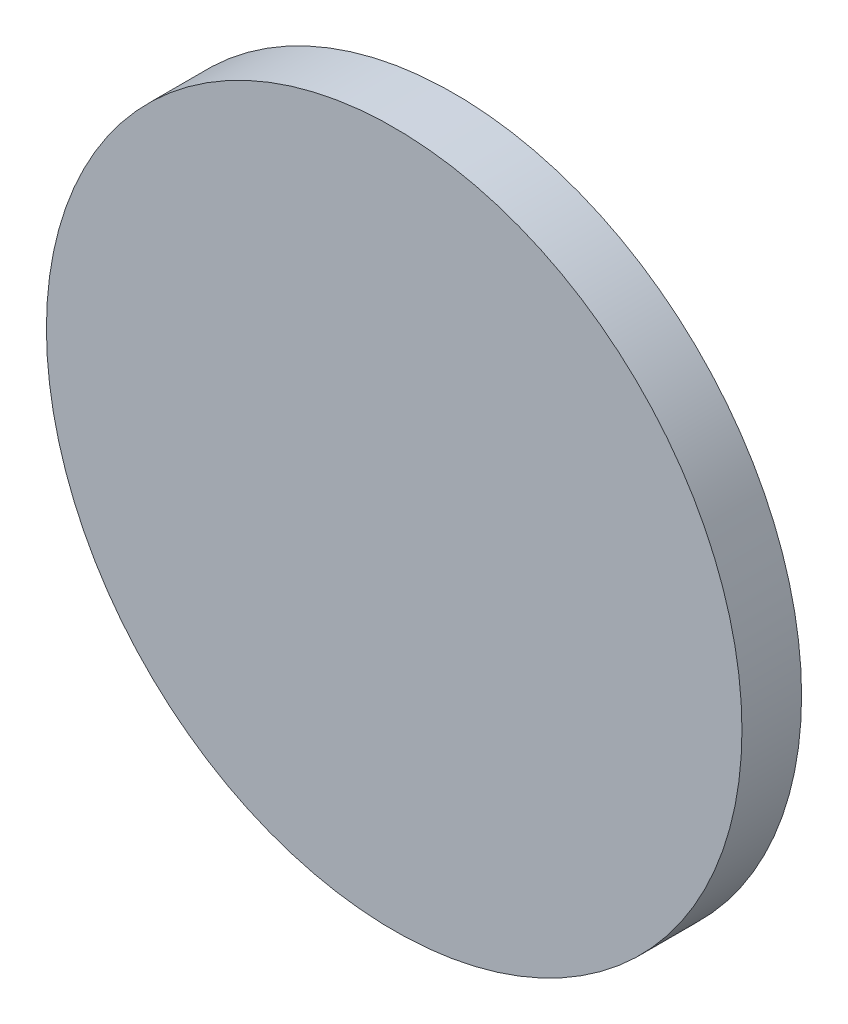
ISO-10303-21;
HEADER;
FILE_DESCRIPTION(('STEP AP214'),'2;1');
FILE_NAME('part.step','',(''),(''),'','','');
FILE_SCHEMA(('AUTOMOTIVE_DESIGN { 1 0 10303 214 1 1 1 1 }'));
ENDSEC;
DATA;
#1=APPLICATION_CONTEXT('core data for automotive mechanical design processes');
#2=APPLICATION_PROTOCOL_DEFINITION('international standard','automotive_design',2000,#1);
#3=PRODUCT_CONTEXT('',#1,'mechanical');
#4=PRODUCT('Part','Part','',(#3));
#5=PRODUCT_RELATED_PRODUCT_CATEGORY('part','',(#4));
#6=PRODUCT_DEFINITION_FORMATION('','',#4);
#7=PRODUCT_DEFINITION_CONTEXT('part definition',#1,'design');
#8=PRODUCT_DEFINITION('design','',#6,#7);
#9=PRODUCT_DEFINITION_SHAPE('','',#8);
#10=(LENGTH_UNIT() NAMED_UNIT(*) SI_UNIT(.MILLI.,.METRE.));
#11=(NAMED_UNIT(*) PLANE_ANGLE_UNIT() SI_UNIT($,.RADIAN.));
#12=(NAMED_UNIT(*) SI_UNIT($,.STERADIAN.) SOLID_ANGLE_UNIT());
#13=UNCERTAINTY_MEASURE_WITH_UNIT(LENGTH_MEASURE(1.E-05),#10,'distance_accuracy_value','');
#14=(GEOMETRIC_REPRESENTATION_CONTEXT(3) GLOBAL_UNCERTAINTY_ASSIGNED_CONTEXT((#13)) GLOBAL_UNIT_ASSIGNED_CONTEXT((#10,
#11,#12)) REPRESENTATION_CONTEXT('',''));
#15=CARTESIAN_POINT('',(0.,0.,0.));
#16=DIRECTION('',(0.,0.,1.));
#17=DIRECTION('',(1.,0.,0.));
#18=AXIS2_PLACEMENT_3D('',#15,#16,#17);
#19=CARTESIAN_POINT('',(1.7145,4.808220006176,0.));
#20=DIRECTION('',(0.,0.,-1.));
#21=DIRECTION('',(-1.,0.,0.));
#22=AXIS2_PLACEMENT_3D('',#19,#20,#21);
#23=PLANE('',#22);
#24=CARTESIAN_POINT('',(1.7145,4.808220006176,0.));
#25=DIRECTION('',(0.,0.,1.));
#26=DIRECTION('',(1.,0.,0.));
#27=AXIS2_PLACEMENT_3D('',#24,#25,#26);
#28=CIRCLE('',#27,0.200024667);
#29=CARTESIAN_POINT('',(1.914524667,4.808220006176,0.));
#30=VERTEX_POINT('',#29);
#31=EDGE_CURVE('E18',#30,#30,#28,.T.);
#32=ORIENTED_EDGE('',*,*,#31,.F.);
#33=EDGE_LOOP('',(#32));
#34=FACE_BOUND('',#33,.T.);
#35=ADVANCED_FACE('F15',(#34),#23,.T.);
#36=CARTESIAN_POINT('',(1.7145,4.808220006176,0.));
#37=DIRECTION('',(0.,0.,1.));
#38=DIRECTION('',(1.,0.,0.));
#39=AXIS2_PLACEMENT_3D('',#36,#37,#38);
#40=CYLINDRICAL_SURFACE('',#39,0.200024667);
#41=CARTESIAN_POINT('',(1.7145,4.808220006176,0.03429));
#42=DIRECTION('',(0.,0.,1.));
#43=DIRECTION('',(1.,0.,0.));
#44=AXIS2_PLACEMENT_3D('',#41,#42,#43);
#45=CIRCLE('',#44,0.200024667);
#46=CARTESIAN_POINT('',(1.914524667,4.808220006176,0.03429));
#47=VERTEX_POINT('',#46);
#48=EDGE_CURVE('E10',#47,#47,#45,.T.);
#49=ORIENTED_EDGE('',*,*,#48,.F.);
#50=EDGE_LOOP('',(#49));
#51=FACE_BOUND('',#50,.T.);
#52=ORIENTED_EDGE('',*,*,#31,.T.);
#53=EDGE_LOOP('',(#52));
#54=FACE_BOUND('',#53,.T.);
#55=ADVANCED_FACE('F27',(#51,#54),#40,.T.);
#56=CARTESIAN_POINT('',(1.7145,4.808220006176,0.03429));
#57=DIRECTION('',(0.,0.,1.));
#58=DIRECTION('',(1.,0.,0.));
#59=AXIS2_PLACEMENT_3D('',#56,#57,#58);
#60=PLANE('',#59);
#61=ORIENTED_EDGE('',*,*,#48,.T.);
#62=EDGE_LOOP('',(#61));
#63=FACE_BOUND('',#62,.T.);
#64=ADVANCED_FACE('F34',(#63),#60,.T.);
#65=CLOSED_SHELL('',(#35,#55,#64));
#66=MANIFOLD_SOLID_BREP('B1',#65);
#67=ADVANCED_BREP_SHAPE_REPRESENTATION('',(#18,#66),#14);
#68=SHAPE_DEFINITION_REPRESENTATION(#9,#67);
ENDSEC;
END-ISO-10303-21;
